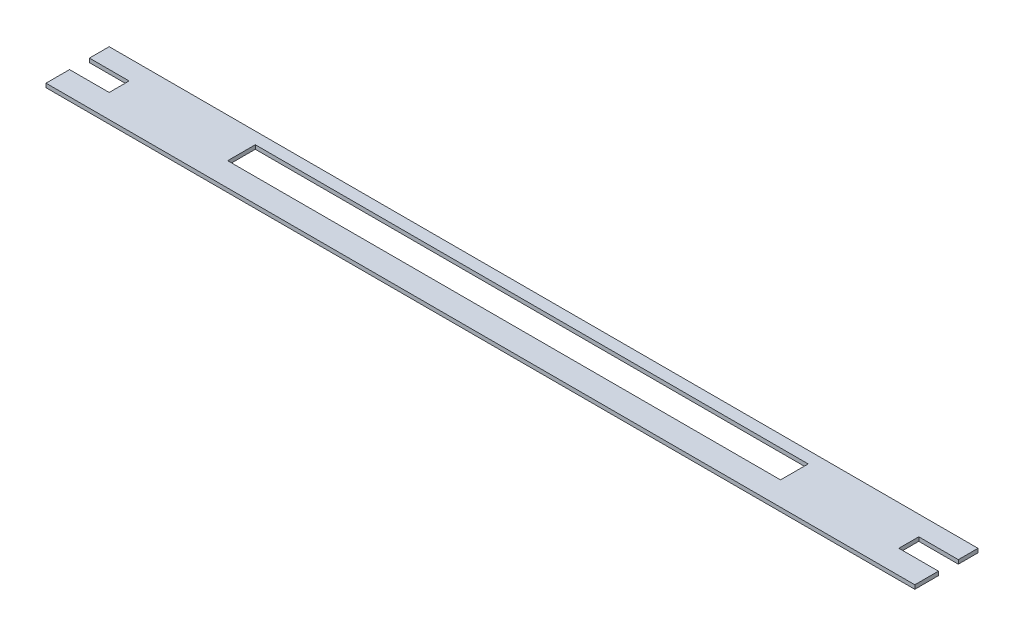
ISO-10303-21;
HEADER;
FILE_DESCRIPTION(('STEP AP214'),'2;1');
FILE_NAME('part.step','',(''),(''),'','','');
FILE_SCHEMA(('AUTOMOTIVE_DESIGN { 1 0 10303 214 1 1 1 1 }'));
ENDSEC;
DATA;
#1=APPLICATION_CONTEXT('core data for automotive mechanical design processes');
#2=APPLICATION_PROTOCOL_DEFINITION('international standard','automotive_design',2000,#1);
#3=PRODUCT_CONTEXT('',#1,'mechanical');
#4=PRODUCT('Part','Part','',(#3));
#5=PRODUCT_RELATED_PRODUCT_CATEGORY('part','',(#4));
#6=PRODUCT_DEFINITION_FORMATION('','',#4);
#7=PRODUCT_DEFINITION_CONTEXT('part definition',#1,'design');
#8=PRODUCT_DEFINITION('design','',#6,#7);
#9=PRODUCT_DEFINITION_SHAPE('','',#8);
#10=(LENGTH_UNIT() NAMED_UNIT(*) SI_UNIT(.MILLI.,.METRE.));
#11=(NAMED_UNIT(*) PLANE_ANGLE_UNIT() SI_UNIT($,.RADIAN.));
#12=(NAMED_UNIT(*) SI_UNIT($,.STERADIAN.) SOLID_ANGLE_UNIT());
#13=UNCERTAINTY_MEASURE_WITH_UNIT(LENGTH_MEASURE(1.E-05),#10,'distance_accuracy_value','');
#14=(GEOMETRIC_REPRESENTATION_CONTEXT(3) GLOBAL_UNCERTAINTY_ASSIGNED_CONTEXT((#13)) GLOBAL_UNIT_ASSIGNED_CONTEXT((#10,
#11,#12)) REPRESENTATION_CONTEXT('',''));
#15=CARTESIAN_POINT('',(0.,0.,0.));
#16=DIRECTION('',(0.,0.,1.));
#17=DIRECTION('',(1.,0.,0.));
#18=AXIS2_PLACEMENT_3D('',#15,#16,#17);
#19=CARTESIAN_POINT('',(597.266258042068,0.,0.));
#20=DIRECTION('',(1.,0.,0.));
#21=DIRECTION('',(0.,0.,-1.));
#22=AXIS2_PLACEMENT_3D('',#19,#20,#21);
#23=PLANE('',#22);
#24=DIRECTION('',(0.,-1.,0.));
#25=VECTOR('',#24,1.);
#26=CARTESIAN_POINT('',(597.266258042068,0.,50.1));
#27=LINE('',#26,#25);
#28=CARTESIAN_POINT('',(597.266258042068,50.,50.1));
#29=VERTEX_POINT('',#28);
#30=CARTESIAN_POINT('',(597.266258042068,45.,50.1));
#31=VERTEX_POINT('',#30);
#32=EDGE_CURVE('E204',#29,#31,#27,.T.);
#33=ORIENTED_EDGE('',*,*,#32,.F.);
#34=DIRECTION('',(0.,0.,-1.));
#35=VECTOR('',#34,1.);
#36=CARTESIAN_POINT('',(597.266258042068,50.,80.));
#37=LINE('',#36,#35);
#38=CARTESIAN_POINT('',(597.266258042068,50.,80.));
#39=VERTEX_POINT('',#38);
#40=EDGE_CURVE('E281',#39,#29,#37,.T.);
#41=ORIENTED_EDGE('',*,*,#40,.F.);
#42=DIRECTION('',(0.,1.,0.));
#43=VECTOR('',#42,1.);
#44=CARTESIAN_POINT('',(597.266258042068,0.,80.));
#45=LINE('',#44,#43);
#46=CARTESIAN_POINT('',(597.266258042068,45.,80.));
#47=VERTEX_POINT('',#46);
#48=EDGE_CURVE('E266',#47,#39,#45,.T.);
#49=ORIENTED_EDGE('',*,*,#48,.F.);
#50=DIRECTION('',(0.,0.,-1.));
#51=VECTOR('',#50,1.);
#52=CARTESIAN_POINT('',(597.266258042068,45.,80.));
#53=LINE('',#52,#51);
#54=EDGE_CURVE('E270',#47,#31,#53,.T.);
#55=ORIENTED_EDGE('',*,*,#54,.T.);
#56=EDGE_LOOP('',(#33,#41,#49,#55));
#57=FACE_BOUND('',#56,.T.);
#58=ADVANCED_FACE('F32',(#57),#23,.T.);
#59=CARTESIAN_POINT('',(-502.733741957931,0.,0.));
#60=DIRECTION('',(1.,0.,0.));
#61=DIRECTION('',(0.,0.,-1.));
#62=AXIS2_PLACEMENT_3D('',#59,#60,#61);
#63=PLANE('',#62);
#64=DIRECTION('',(0.,1.,0.));
#65=VECTOR('',#64,1.);
#66=CARTESIAN_POINT('',(-502.733741957931,0.,0.));
#67=LINE('',#66,#65);
#68=CARTESIAN_POINT('',(-502.733741957931,45.,0.));
#69=VERTEX_POINT('',#68);
#70=CARTESIAN_POINT('',(-502.733741957931,50.,0.));
#71=VERTEX_POINT('',#70);
#72=EDGE_CURVE('E213',#69,#71,#67,.T.);
#73=ORIENTED_EDGE('',*,*,#72,.F.);
#74=DIRECTION('',(0.,0.,-1.));
#75=VECTOR('',#74,1.);
#76=CARTESIAN_POINT('',(-502.733741957931,45.,80.));
#77=LINE('',#76,#75);
#78=CARTESIAN_POINT('',(-502.733741957931,45.,25.));
#79=VERTEX_POINT('',#78);
#80=EDGE_CURVE('E280',#79,#69,#77,.T.);
#81=ORIENTED_EDGE('',*,*,#80,.F.);
#82=DIRECTION('',(0.,-1.,0.));
#83=VECTOR('',#82,1.);
#84=CARTESIAN_POINT('',(-502.733741957931,50.,25.));
#85=LINE('',#84,#83);
#86=CARTESIAN_POINT('',(-502.733741957931,50.,25.));
#87=VERTEX_POINT('',#86);
#88=EDGE_CURVE('E221',#87,#79,#85,.T.);
#89=ORIENTED_EDGE('',*,*,#88,.F.);
#90=DIRECTION('',(0.,0.,-1.));
#91=VECTOR('',#90,1.);
#92=CARTESIAN_POINT('',(-502.733741957931,50.,80.));
#93=LINE('',#92,#91);
#94=EDGE_CURVE('E274',#87,#71,#93,.T.);
#95=ORIENTED_EDGE('',*,*,#94,.T.);
#96=EDGE_LOOP('',(#73,#81,#89,#95));
#97=FACE_BOUND('',#96,.T.);
#98=ADVANCED_FACE('F312',(#97),#63,.F.);
#99=CARTESIAN_POINT('',(597.266258042068,45.,5.));
#100=DIRECTION('',(0.,-1.,0.));
#101=DIRECTION('',(0.,0.,-1.));
#102=AXIS2_PLACEMENT_3D('',#99,#100,#101);
#103=PLANE('',#102);
#104=DIRECTION('',(1.,0.,0.));
#105=VECTOR('',#104,1.);
#106=CARTESIAN_POINT('',(-502.733741957931,45.,0.));
#107=LINE('',#106,#105);
#108=CARTESIAN_POINT('',(597.266258042068,45.,0.));
#109=VERTEX_POINT('',#108);
#110=EDGE_CURVE('E210',#69,#109,#107,.T.);
#111=ORIENTED_EDGE('',*,*,#110,.T.);
#112=CARTESIAN_POINT('',(597.266258042068,45.,24.9));
#113=VERTEX_POINT('',#112);
#114=EDGE_CURVE('E265',#113,#109,#53,.T.);
#115=ORIENTED_EDGE('',*,*,#114,.F.);
#116=DIRECTION('',(1.,0.,0.));
#117=VECTOR('',#116,1.);
#118=CARTESIAN_POINT('',(597.266258042068,45.,24.9));
#119=LINE('',#118,#117);
#120=CARTESIAN_POINT('',(547.166258042068,45.,24.9));
#121=VERTEX_POINT('',#120);
#122=EDGE_CURVE('E208',#121,#113,#119,.T.);
#123=ORIENTED_EDGE('',*,*,#122,.F.);
#124=DIRECTION('',(0.,0.,-1.));
#125=VECTOR('',#124,1.);
#126=CARTESIAN_POINT('',(547.166258042068,45.,5.));
#127=LINE('',#126,#125);
#128=CARTESIAN_POINT('',(547.166258042068,45.,50.1));
#129=VERTEX_POINT('',#128);
#130=EDGE_CURVE('E199',#129,#121,#127,.T.);
#131=ORIENTED_EDGE('',*,*,#130,.F.);
#132=DIRECTION('',(-1.,0.,0.));
#133=VECTOR('',#132,1.);
#134=CARTESIAN_POINT('',(597.266258042068,45.,50.1));
#135=LINE('',#134,#133);
#136=EDGE_CURVE('E202',#31,#129,#135,.T.);
#137=ORIENTED_EDGE('',*,*,#136,.F.);
#138=ORIENTED_EDGE('',*,*,#54,.F.);
#139=DIRECTION('',(-1.,0.,0.));
#140=VECTOR('',#139,1.);
#141=CARTESIAN_POINT('',(-502.733741957931,45.,80.));
#142=LINE('',#141,#140);
#143=CARTESIAN_POINT('',(-502.733741957931,45.,80.));
#144=VERTEX_POINT('',#143);
#145=EDGE_CURVE('E275',#47,#144,#142,.T.);
#146=ORIENTED_EDGE('',*,*,#145,.T.);
#147=CARTESIAN_POINT('',(-502.733741957931,45.,50.2));
#148=VERTEX_POINT('',#147);
#149=EDGE_CURVE('E284',#144,#148,#77,.T.);
#150=ORIENTED_EDGE('',*,*,#149,.T.);
#151=DIRECTION('',(-1.,0.,0.));
#152=VECTOR('',#151,1.);
#153=CARTESIAN_POINT('',(597.266258042068,45.,50.2));
#154=LINE('',#153,#152);
#155=CARTESIAN_POINT('',(-452.533741957932,45.,50.2));
#156=VERTEX_POINT('',#155);
#157=EDGE_CURVE('E188',#156,#148,#154,.T.);
#158=ORIENTED_EDGE('',*,*,#157,.F.);
#159=DIRECTION('',(0.,0.,1.));
#160=VECTOR('',#159,1.);
#161=CARTESIAN_POINT('',(-452.533741957932,45.,5.));
#162=LINE('',#161,#160);
#163=CARTESIAN_POINT('',(-452.533741957932,45.,25.0558642761631));
#164=VERTEX_POINT('',#163);
#165=EDGE_CURVE('E164',#164,#156,#162,.T.);
#166=ORIENTED_EDGE('',*,*,#165,.F.);
#167=DIRECTION('',(1.,0.,0.));
#168=VECTOR('',#167,1.);
#169=CARTESIAN_POINT('',(597.266258042068,45.,25.0558642761631));
#170=LINE('',#169,#168);
#171=CARTESIAN_POINT('',(-452.733741957932,45.,25.0558642761631));
#172=VERTEX_POINT('',#171);
#173=EDGE_CURVE('E183',#172,#164,#170,.T.);
#174=ORIENTED_EDGE('',*,*,#173,.F.);
#175=DIRECTION('',(0.,0.,1.));
#176=VECTOR('',#175,1.);
#177=CARTESIAN_POINT('',(-452.733741957932,45.,25.));
#178=LINE('',#177,#176);
#179=CARTESIAN_POINT('',(-452.733741957932,45.,25.));
#180=VERTEX_POINT('',#179);
#181=EDGE_CURVE('E225',#180,#172,#178,.T.);
#182=ORIENTED_EDGE('',*,*,#181,.F.);
#183=DIRECTION('',(-1.,0.,0.));
#184=VECTOR('',#183,1.);
#185=CARTESIAN_POINT('',(-452.733741957932,45.,25.));
#186=LINE('',#185,#184);
#187=EDGE_CURVE('E230',#180,#79,#186,.T.);
#188=ORIENTED_EDGE('',*,*,#187,.T.);
#189=ORIENTED_EDGE('',*,*,#80,.T.);
#190=EDGE_LOOP('',(#111,#115,#123,#131,#137,#138,#146,#150,#158,#166,#174,#182,#188,#189));
#191=FACE_BOUND('',#190,.T.);
#192=DIRECTION('',(0.,0.,-1.));
#193=VECTOR('',#192,1.);
#194=CARTESIAN_POINT('',(-302.733741957932,45.,5.));
#195=LINE('',#194,#193);
#196=CARTESIAN_POINT('',(-302.733741957931,45.,50.));
#197=VERTEX_POINT('',#196);
#198=CARTESIAN_POINT('',(-302.733741957931,45.,15.));
#199=VERTEX_POINT('',#198);
#200=EDGE_CURVE('E263',#197,#199,#195,.T.);
#201=ORIENTED_EDGE('',*,*,#200,.F.);
#202=DIRECTION('',(-1.,0.,0.));
#203=VECTOR('',#202,1.);
#204=CARTESIAN_POINT('',(597.266258042068,45.,50.));
#205=LINE('',#204,#203);
#206=CARTESIAN_POINT('',(397.266258042068,45.,50.));
#207=VERTEX_POINT('',#206);
#208=EDGE_CURVE('E250',#207,#197,#205,.T.);
#209=ORIENTED_EDGE('',*,*,#208,.F.);
#210=DIRECTION('',(0.,0.,1.));
#211=VECTOR('',#210,1.);
#212=CARTESIAN_POINT('',(397.266258042068,45.,5.));
#213=LINE('',#212,#211);
#214=CARTESIAN_POINT('',(397.266258042068,45.,15.));
#215=VERTEX_POINT('',#214);
#216=EDGE_CURVE('E258',#215,#207,#213,.T.);
#217=ORIENTED_EDGE('',*,*,#216,.F.);
#218=DIRECTION('',(1.,0.,0.));
#219=VECTOR('',#218,1.);
#220=CARTESIAN_POINT('',(597.266258042068,45.,15.));
#221=LINE('',#220,#219);
#222=EDGE_CURVE('E261',#199,#215,#221,.T.);
#223=ORIENTED_EDGE('',*,*,#222,.F.);
#224=EDGE_LOOP('',(#201,#209,#217,#223));
#225=FACE_BOUND('',#224,.T.);
#226=ADVANCED_FACE('F305',(#191,#225),#103,.T.);
#227=DIRECTION('',(0.,-1.,0.));
#228=VECTOR('',#227,1.);
#229=CARTESIAN_POINT('',(597.266258042068,0.,0.));
#230=LINE('',#229,#228);
#231=CARTESIAN_POINT('',(597.266258042068,50.,0.));
#232=VERTEX_POINT('',#231);
#233=EDGE_CURVE('E218',#232,#109,#230,.T.);
#234=ORIENTED_EDGE('',*,*,#233,.F.);
#235=CARTESIAN_POINT('',(597.266258042068,50.,24.9));
#236=VERTEX_POINT('',#235);
#237=EDGE_CURVE('E269',#236,#232,#37,.T.);
#238=ORIENTED_EDGE('',*,*,#237,.F.);
#239=DIRECTION('',(0.,1.,0.));
#240=VECTOR('',#239,1.);
#241=CARTESIAN_POINT('',(597.266258042068,0.,24.9));
#242=LINE('',#241,#240);
#243=EDGE_CURVE('E206',#113,#236,#242,.T.);
#244=ORIENTED_EDGE('',*,*,#243,.F.);
#245=ORIENTED_EDGE('',*,*,#114,.T.);
#246=EDGE_LOOP('',(#234,#238,#244,#245));
#247=FACE_BOUND('',#246,.T.);
#248=ADVANCED_FACE('F297',(#247),#23,.T.);
#249=CARTESIAN_POINT('',(-502.733741957931,0.,80.));
#250=DIRECTION('',(0.,0.,1.));
#251=DIRECTION('',(1.,0.,0.));
#252=AXIS2_PLACEMENT_3D('',#249,#250,#251);
#253=PLANE('',#252);
#254=DIRECTION('',(0.,1.,0.));
#255=VECTOR('',#254,1.);
#256=CARTESIAN_POINT('',(-502.733741957931,0.,80.));
#257=LINE('',#256,#255);
#258=CARTESIAN_POINT('',(-502.733741957931,50.,80.));
#259=VERTEX_POINT('',#258);
#260=EDGE_CURVE('E271',#144,#259,#257,.T.);
#261=ORIENTED_EDGE('',*,*,#260,.F.);
#262=ORIENTED_EDGE('',*,*,#145,.F.);
#263=ORIENTED_EDGE('',*,*,#48,.T.);
#264=DIRECTION('',(-1.,0.,0.));
#265=VECTOR('',#264,1.);
#266=CARTESIAN_POINT('',(-502.733741957931,50.,80.));
#267=LINE('',#266,#265);
#268=EDGE_CURVE('E277',#39,#259,#267,.T.);
#269=ORIENTED_EDGE('',*,*,#268,.T.);
#270=EDGE_LOOP('',(#261,#262,#263,#269));
#271=FACE_BOUND('',#270,.T.);
#272=ADVANCED_FACE('F327',(#271),#253,.T.);
#273=CARTESIAN_POINT('',(-502.733741957931,50.,50.2));
#274=VERTEX_POINT('',#273);
#275=EDGE_CURVE('E40',#259,#274,#93,.T.);
#276=ORIENTED_EDGE('',*,*,#275,.T.);
#277=DIRECTION('',(0.,-1.,0.));
#278=VECTOR('',#277,1.);
#279=CARTESIAN_POINT('',(-502.733741957931,0.,50.2));
#280=LINE('',#279,#278);
#281=EDGE_CURVE('E173',#274,#148,#280,.T.);
#282=ORIENTED_EDGE('',*,*,#281,.T.);
#283=ORIENTED_EDGE('',*,*,#149,.F.);
#284=ORIENTED_EDGE('',*,*,#260,.T.);
#285=EDGE_LOOP('',(#276,#282,#283,#284));
#286=FACE_BOUND('',#285,.T.);
#287=ADVANCED_FACE('F330',(#286),#63,.F.);
#288=CARTESIAN_POINT('',(-502.733741957931,50.,80.));
#289=DIRECTION('',(0.,-1.,0.));
#290=DIRECTION('',(0.,0.,-1.));
#291=AXIS2_PLACEMENT_3D('',#288,#289,#290);
#292=PLANE('',#291);
#293=DIRECTION('',(-1.,0.,0.));
#294=VECTOR('',#293,1.);
#295=CARTESIAN_POINT('',(-502.733741957931,50.,0.));
#296=LINE('',#295,#294);
#297=EDGE_CURVE('E211',#232,#71,#296,.T.);
#298=ORIENTED_EDGE('',*,*,#297,.T.);
#299=ORIENTED_EDGE('',*,*,#94,.F.);
#300=DIRECTION('',(-1.,0.,0.));
#301=VECTOR('',#300,1.);
#302=CARTESIAN_POINT('',(-452.733741957932,50.,25.));
#303=LINE('',#302,#301);
#304=CARTESIAN_POINT('',(-452.733741957932,50.,25.));
#305=VERTEX_POINT('',#304);
#306=EDGE_CURVE('E232',#305,#87,#303,.T.);
#307=ORIENTED_EDGE('',*,*,#306,.F.);
#308=DIRECTION('',(0.,0.,-1.));
#309=VECTOR('',#308,1.);
#310=CARTESIAN_POINT('',(-452.733741957932,50.,25.));
#311=LINE('',#310,#309);
#312=CARTESIAN_POINT('',(-452.733741957932,50.,25.0558642761631));
#313=VERTEX_POINT('',#312);
#314=EDGE_CURVE('E228',#313,#305,#311,.T.);
#315=ORIENTED_EDGE('',*,*,#314,.F.);
#316=DIRECTION('',(-1.,0.,0.));
#317=VECTOR('',#316,1.);
#318=CARTESIAN_POINT('',(-452.533741957932,50.,25.0558642761631));
#319=LINE('',#318,#317);
#320=CARTESIAN_POINT('',(-452.533741957932,50.,25.0558642761631));
#321=VERTEX_POINT('',#320);
#322=EDGE_CURVE('E46',#321,#313,#319,.T.);
#323=ORIENTED_EDGE('',*,*,#322,.F.);
#324=DIRECTION('',(0.,0.,-1.));
#325=VECTOR('',#324,1.);
#326=CARTESIAN_POINT('',(-452.533741957932,50.,50.2));
#327=LINE('',#326,#325);
#328=CARTESIAN_POINT('',(-452.533741957932,50.,50.2));
#329=VERTEX_POINT('',#328);
#330=EDGE_CURVE('E162',#329,#321,#327,.T.);
#331=ORIENTED_EDGE('',*,*,#330,.F.);
#332=DIRECTION('',(1.,0.,0.));
#333=VECTOR('',#332,1.);
#334=CARTESIAN_POINT('',(-452.533741957932,50.,50.2));
#335=LINE('',#334,#333);
#336=EDGE_CURVE('E170',#274,#329,#335,.T.);
#337=ORIENTED_EDGE('',*,*,#336,.F.);
#338=ORIENTED_EDGE('',*,*,#275,.F.);
#339=ORIENTED_EDGE('',*,*,#268,.F.);
#340=ORIENTED_EDGE('',*,*,#40,.T.);
#341=DIRECTION('',(1.,0.,0.));
#342=VECTOR('',#341,1.);
#343=CARTESIAN_POINT('',(547.166258042068,50.,50.1));
#344=LINE('',#343,#342);
#345=CARTESIAN_POINT('',(547.166258042068,50.,50.1));
#346=VERTEX_POINT('',#345);
#347=EDGE_CURVE('E194',#346,#29,#344,.T.);
#348=ORIENTED_EDGE('',*,*,#347,.F.);
#349=DIRECTION('',(0.,0.,1.));
#350=VECTOR('',#349,1.);
#351=CARTESIAN_POINT('',(547.166258042068,50.,24.9));
#352=LINE('',#351,#350);
#353=CARTESIAN_POINT('',(547.166258042068,50.,24.9));
#354=VERTEX_POINT('',#353);
#355=EDGE_CURVE('E191',#354,#346,#352,.T.);
#356=ORIENTED_EDGE('',*,*,#355,.F.);
#357=DIRECTION('',(-1.,0.,0.));
#358=VECTOR('',#357,1.);
#359=CARTESIAN_POINT('',(547.166258042068,50.,24.9));
#360=LINE('',#359,#358);
#361=EDGE_CURVE('E54',#236,#354,#360,.T.);
#362=ORIENTED_EDGE('',*,*,#361,.F.);
#363=ORIENTED_EDGE('',*,*,#237,.T.);
#364=EDGE_LOOP('',(#298,#299,#307,#315,#323,#331,#337,#338,#339,#340,#348,#356,#362,#363));
#365=FACE_BOUND('',#364,.T.);
#366=DIRECTION('',(1.,0.,0.));
#367=VECTOR('',#366,1.);
#368=CARTESIAN_POINT('',(-302.733741957931,50.,50.));
#369=LINE('',#368,#367);
#370=CARTESIAN_POINT('',(-302.733741957931,50.,50.));
#371=VERTEX_POINT('',#370);
#372=CARTESIAN_POINT('',(397.266258042068,50.,50.));
#373=VERTEX_POINT('',#372);
#374=EDGE_CURVE('E238',#371,#373,#369,.T.);
#375=ORIENTED_EDGE('',*,*,#374,.F.);
#376=DIRECTION('',(0.,0.,1.));
#377=VECTOR('',#376,1.);
#378=CARTESIAN_POINT('',(-302.733741957931,50.,15.));
#379=LINE('',#378,#377);
#380=CARTESIAN_POINT('',(-302.733741957931,50.,15.));
#381=VERTEX_POINT('',#380);
#382=EDGE_CURVE('E234',#381,#371,#379,.T.);
#383=ORIENTED_EDGE('',*,*,#382,.F.);
#384=DIRECTION('',(-1.,0.,0.));
#385=VECTOR('',#384,1.);
#386=CARTESIAN_POINT('',(-302.733741957931,50.,15.));
#387=LINE('',#386,#385);
#388=CARTESIAN_POINT('',(397.266258042068,50.,15.));
#389=VERTEX_POINT('',#388);
#390=EDGE_CURVE('E244',#389,#381,#387,.T.);
#391=ORIENTED_EDGE('',*,*,#390,.F.);
#392=DIRECTION('',(0.,0.,-1.));
#393=VECTOR('',#392,1.);
#394=CARTESIAN_POINT('',(397.266258042068,50.,15.));
#395=LINE('',#394,#393);
#396=EDGE_CURVE('E241',#373,#389,#395,.T.);
#397=ORIENTED_EDGE('',*,*,#396,.F.);
#398=EDGE_LOOP('',(#375,#383,#391,#397));
#399=FACE_BOUND('',#398,.T.);
#400=ADVANCED_FACE('F34',(#365,#399),#292,.F.);
#401=CARTESIAN_POINT('',(-302.733741957931,40.,15.));
#402=DIRECTION('',(-1.,0.,0.));
#403=DIRECTION('',(0.,0.,1.));
#404=AXIS2_PLACEMENT_3D('',#401,#402,#403);
#405=PLANE('',#404);
#406=ORIENTED_EDGE('',*,*,#200,.T.);
#407=DIRECTION('',(0.,1.,0.));
#408=VECTOR('',#407,1.);
#409=CARTESIAN_POINT('',(-302.733741957931,40.,15.));
#410=LINE('',#409,#408);
#411=EDGE_CURVE('E248',#199,#381,#410,.T.);
#412=ORIENTED_EDGE('',*,*,#411,.T.);
#413=ORIENTED_EDGE('',*,*,#382,.T.);
#414=DIRECTION('',(0.,1.,0.));
#415=VECTOR('',#414,1.);
#416=CARTESIAN_POINT('',(-302.733741957931,40.,50.));
#417=LINE('',#416,#415);
#418=EDGE_CURVE('E247',#197,#371,#417,.T.);
#419=ORIENTED_EDGE('',*,*,#418,.F.);
#420=EDGE_LOOP('',(#406,#412,#413,#419));
#421=FACE_BOUND('',#420,.T.);
#422=ADVANCED_FACE('F337',(#421),#405,.F.);
#423=CARTESIAN_POINT('',(-302.733741957931,40.,15.));
#424=DIRECTION('',(0.,0.,-1.));
#425=DIRECTION('',(-1.,0.,0.));
#426=AXIS2_PLACEMENT_3D('',#423,#424,#425);
#427=PLANE('',#426);
#428=ORIENTED_EDGE('',*,*,#222,.T.);
#429=DIRECTION('',(0.,1.,0.));
#430=VECTOR('',#429,1.);
#431=CARTESIAN_POINT('',(397.266258042068,40.,15.));
#432=LINE('',#431,#430);
#433=EDGE_CURVE('E251',#215,#389,#432,.T.);
#434=ORIENTED_EDGE('',*,*,#433,.T.);
#435=ORIENTED_EDGE('',*,*,#390,.T.);
#436=ORIENTED_EDGE('',*,*,#411,.F.);
#437=EDGE_LOOP('',(#428,#434,#435,#436));
#438=FACE_BOUND('',#437,.T.);
#439=ADVANCED_FACE('F437',(#438),#427,.F.);
#440=CARTESIAN_POINT('',(397.266258042068,40.,15.));
#441=DIRECTION('',(1.,0.,0.));
#442=DIRECTION('',(0.,0.,-1.));
#443=AXIS2_PLACEMENT_3D('',#440,#441,#442);
#444=PLANE('',#443);
#445=ORIENTED_EDGE('',*,*,#216,.T.);
#446=DIRECTION('',(0.,1.,0.));
#447=VECTOR('',#446,1.);
#448=CARTESIAN_POINT('',(397.266258042068,40.,50.));
#449=LINE('',#448,#447);
#450=EDGE_CURVE('E253',#207,#373,#449,.T.);
#451=ORIENTED_EDGE('',*,*,#450,.T.);
#452=ORIENTED_EDGE('',*,*,#396,.T.);
#453=ORIENTED_EDGE('',*,*,#433,.F.);
#454=EDGE_LOOP('',(#445,#451,#452,#453));
#455=FACE_BOUND('',#454,.T.);
#456=ADVANCED_FACE('F432',(#455),#444,.F.);
#457=CARTESIAN_POINT('',(-302.733741957931,40.,50.));
#458=DIRECTION('',(0.,0.,1.));
#459=DIRECTION('',(1.,0.,0.));
#460=AXIS2_PLACEMENT_3D('',#457,#458,#459);
#461=PLANE('',#460);
#462=ORIENTED_EDGE('',*,*,#208,.T.);
#463=ORIENTED_EDGE('',*,*,#418,.T.);
#464=ORIENTED_EDGE('',*,*,#374,.T.);
#465=ORIENTED_EDGE('',*,*,#450,.F.);
#466=EDGE_LOOP('',(#462,#463,#464,#465));
#467=FACE_BOUND('',#466,.T.);
#468=ADVANCED_FACE('F405',(#467),#461,.F.);
#469=CARTESIAN_POINT('',(-452.733741957932,50.,25.));
#470=DIRECTION('',(0.,0.,-1.));
#471=DIRECTION('',(-1.,0.,0.));
#472=AXIS2_PLACEMENT_3D('',#469,#470,#471);
#473=PLANE('',#472);
#474=ORIENTED_EDGE('',*,*,#88,.T.);
#475=ORIENTED_EDGE('',*,*,#187,.F.);
#476=DIRECTION('',(0.,-1.,0.));
#477=VECTOR('',#476,1.);
#478=CARTESIAN_POINT('',(-452.733741957932,50.,25.));
#479=LINE('',#478,#477);
#480=EDGE_CURVE('E222',#305,#180,#479,.T.);
#481=ORIENTED_EDGE('',*,*,#480,.F.);
#482=ORIENTED_EDGE('',*,*,#306,.T.);
#483=EDGE_LOOP('',(#474,#475,#481,#482));
#484=FACE_BOUND('',#483,.T.);
#485=ADVANCED_FACE('F399',(#484),#473,.F.);
#486=CARTESIAN_POINT('',(-452.733741957932,0.,0.));
#487=DIRECTION('',(-1.,0.,0.));
#488=DIRECTION('',(0.,0.,1.));
#489=AXIS2_PLACEMENT_3D('',#486,#487,#488);
#490=PLANE('',#489);
#491=DIRECTION('',(0.,-1.,0.));
#492=VECTOR('',#491,1.);
#493=CARTESIAN_POINT('',(-452.733741957932,0.,25.0558642761631));
#494=LINE('',#493,#492);
#495=EDGE_CURVE('E11',#313,#172,#494,.T.);
#496=ORIENTED_EDGE('',*,*,#495,.F.);
#497=ORIENTED_EDGE('',*,*,#314,.T.);
#498=ORIENTED_EDGE('',*,*,#480,.T.);
#499=ORIENTED_EDGE('',*,*,#181,.T.);
#500=EDGE_LOOP('',(#496,#497,#498,#499));
#501=FACE_BOUND('',#500,.T.);
#502=ADVANCED_FACE('F404',(#501),#490,.T.);
#503=CARTESIAN_POINT('',(-502.733741957931,0.,0.));
#504=DIRECTION('',(0.,0.,1.));
#505=DIRECTION('',(1.,0.,0.));
#506=AXIS2_PLACEMENT_3D('',#503,#504,#505);
#507=PLANE('',#506);
#508=ORIENTED_EDGE('',*,*,#297,.F.);
#509=ORIENTED_EDGE('',*,*,#233,.T.);
#510=ORIENTED_EDGE('',*,*,#110,.F.);
#511=ORIENTED_EDGE('',*,*,#72,.T.);
#512=EDGE_LOOP('',(#508,#509,#510,#511));
#513=FACE_BOUND('',#512,.T.);
#514=ADVANCED_FACE('F304',(#513),#507,.F.);
#515=CARTESIAN_POINT('',(547.166258042068,-50.,24.9));
#516=DIRECTION('',(0.,0.,-1.));
#517=DIRECTION('',(-1.,0.,0.));
#518=AXIS2_PLACEMENT_3D('',#515,#516,#517);
#519=PLANE('',#518);
#520=ORIENTED_EDGE('',*,*,#122,.T.);
#521=ORIENTED_EDGE('',*,*,#243,.T.);
#522=ORIENTED_EDGE('',*,*,#361,.T.);
#523=DIRECTION('',(0.,1.,0.));
#524=VECTOR('',#523,1.);
#525=CARTESIAN_POINT('',(547.166258042068,-50.,24.9));
#526=LINE('',#525,#524);
#527=EDGE_CURVE('E196',#121,#354,#526,.T.);
#528=ORIENTED_EDGE('',*,*,#527,.F.);
#529=EDGE_LOOP('',(#520,#521,#522,#528));
#530=FACE_BOUND('',#529,.T.);
#531=ADVANCED_FACE('F321',(#530),#519,.F.);
#532=CARTESIAN_POINT('',(547.166258042068,-50.,50.1));
#533=DIRECTION('',(0.,0.,1.));
#534=DIRECTION('',(1.,0.,0.));
#535=AXIS2_PLACEMENT_3D('',#532,#533,#534);
#536=PLANE('',#535);
#537=ORIENTED_EDGE('',*,*,#32,.T.);
#538=ORIENTED_EDGE('',*,*,#136,.T.);
#539=DIRECTION('',(0.,1.,0.));
#540=VECTOR('',#539,1.);
#541=CARTESIAN_POINT('',(547.166258042068,-50.,50.1));
#542=LINE('',#541,#540);
#543=EDGE_CURVE('E197',#129,#346,#542,.T.);
#544=ORIENTED_EDGE('',*,*,#543,.T.);
#545=ORIENTED_EDGE('',*,*,#347,.T.);
#546=EDGE_LOOP('',(#537,#538,#544,#545));
#547=FACE_BOUND('',#546,.T.);
#548=ADVANCED_FACE('F324',(#547),#536,.F.);
#549=CARTESIAN_POINT('',(547.166258042068,-50.,24.9));
#550=DIRECTION('',(-1.,0.,0.));
#551=DIRECTION('',(0.,0.,1.));
#552=AXIS2_PLACEMENT_3D('',#549,#550,#551);
#553=PLANE('',#552);
#554=ORIENTED_EDGE('',*,*,#130,.T.);
#555=ORIENTED_EDGE('',*,*,#527,.T.);
#556=ORIENTED_EDGE('',*,*,#355,.T.);
#557=ORIENTED_EDGE('',*,*,#543,.F.);
#558=EDGE_LOOP('',(#554,#555,#556,#557));
#559=FACE_BOUND('',#558,.T.);
#560=ADVANCED_FACE('F319',(#559),#553,.F.);
#561=CARTESIAN_POINT('',(-452.533741957932,-50.,50.2));
#562=DIRECTION('',(0.,0.,1.));
#563=DIRECTION('',(1.,0.,0.));
#564=AXIS2_PLACEMENT_3D('',#561,#562,#563);
#565=PLANE('',#564);
#566=ORIENTED_EDGE('',*,*,#157,.T.);
#567=ORIENTED_EDGE('',*,*,#281,.F.);
#568=ORIENTED_EDGE('',*,*,#336,.T.);
#569=DIRECTION('',(0.,1.,0.));
#570=VECTOR('',#569,1.);
#571=CARTESIAN_POINT('',(-452.533741957932,-50.,50.2));
#572=LINE('',#571,#570);
#573=EDGE_CURVE('E157',#156,#329,#572,.T.);
#574=ORIENTED_EDGE('',*,*,#573,.F.);
#575=EDGE_LOOP('',(#566,#567,#568,#574));
#576=FACE_BOUND('',#575,.T.);
#577=ADVANCED_FACE('F171',(#576),#565,.F.);
#578=CARTESIAN_POINT('',(-452.533741957932,-50.,25.0558642761631));
#579=DIRECTION('',(0.,0.,-1.));
#580=DIRECTION('',(-1.,0.,0.));
#581=AXIS2_PLACEMENT_3D('',#578,#579,#580);
#582=PLANE('',#581);
#583=ORIENTED_EDGE('',*,*,#173,.T.);
#584=DIRECTION('',(0.,1.,0.));
#585=VECTOR('',#584,1.);
#586=CARTESIAN_POINT('',(-452.533741957932,-50.,25.0558642761631));
#587=LINE('',#586,#585);
#588=EDGE_CURVE('E167',#164,#321,#587,.T.);
#589=ORIENTED_EDGE('',*,*,#588,.T.);
#590=ORIENTED_EDGE('',*,*,#322,.T.);
#591=ORIENTED_EDGE('',*,*,#495,.T.);
#592=EDGE_LOOP('',(#583,#589,#590,#591));
#593=FACE_BOUND('',#592,.T.);
#594=ADVANCED_FACE('F381',(#593),#582,.F.);
#595=CARTESIAN_POINT('',(-452.533741957932,-50.,50.2));
#596=DIRECTION('',(1.,0.,0.));
#597=DIRECTION('',(0.,0.,-1.));
#598=AXIS2_PLACEMENT_3D('',#595,#596,#597);
#599=PLANE('',#598);
#600=ORIENTED_EDGE('',*,*,#165,.T.);
#601=ORIENTED_EDGE('',*,*,#573,.T.);
#602=ORIENTED_EDGE('',*,*,#330,.T.);
#603=ORIENTED_EDGE('',*,*,#588,.F.);
#604=EDGE_LOOP('',(#600,#601,#602,#603));
#605=FACE_BOUND('',#604,.T.);
#606=ADVANCED_FACE('F159',(#605),#599,.F.);
#607=CLOSED_SHELL('',(#58,#98,#226,#248,#272,#287,#400,#422,#439,#456,#468,#485,#502,#514,#531,
#548,#560,#577,#594,#606));
#608=MANIFOLD_SOLID_BREP('B2',#607);
#609=ADVANCED_BREP_SHAPE_REPRESENTATION('',(#18,#608),#14);
#610=SHAPE_DEFINITION_REPRESENTATION(#9,#609);
ENDSEC;
END-ISO-10303-21;
